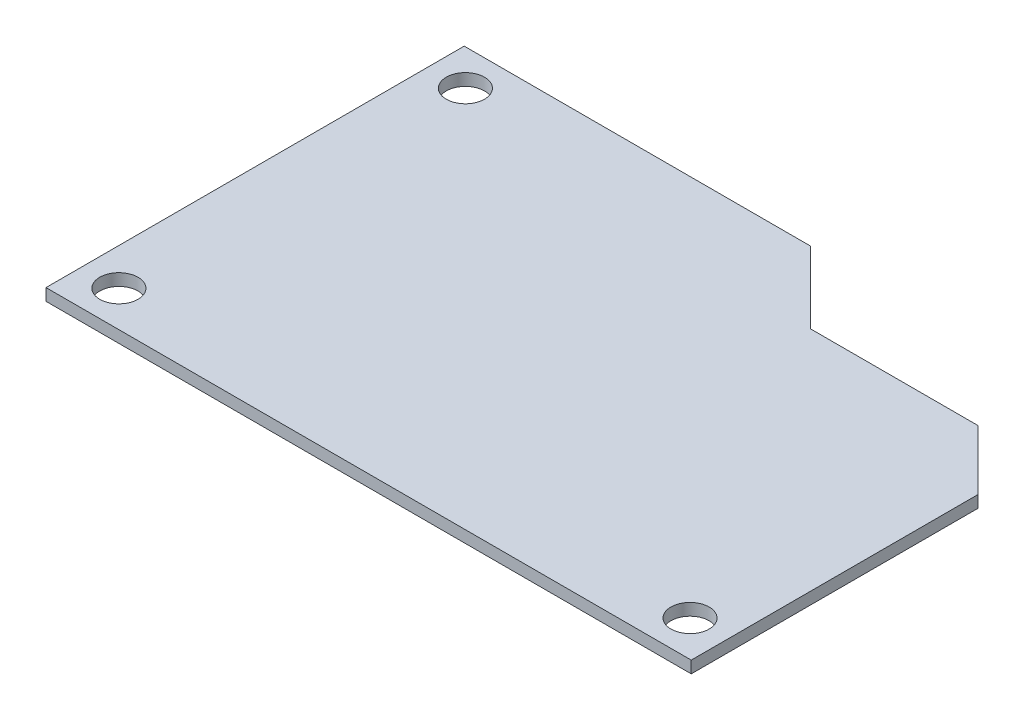
ISO-10303-21;
HEADER;
FILE_DESCRIPTION(('STEP AP214'),'2;1');
FILE_NAME('part.step','',(''),(''),'','','');
FILE_SCHEMA(('AUTOMOTIVE_DESIGN { 1 0 10303 214 1 1 1 1 }'));
ENDSEC;
DATA;
#1=APPLICATION_CONTEXT('core data for automotive mechanical design processes');
#2=APPLICATION_PROTOCOL_DEFINITION('international standard','automotive_design',2000,#1);
#3=PRODUCT_CONTEXT('',#1,'mechanical');
#4=PRODUCT('Part','Part','',(#3));
#5=PRODUCT_RELATED_PRODUCT_CATEGORY('part','',(#4));
#6=PRODUCT_DEFINITION_FORMATION('','',#4);
#7=PRODUCT_DEFINITION_CONTEXT('part definition',#1,'design');
#8=PRODUCT_DEFINITION('design','',#6,#7);
#9=PRODUCT_DEFINITION_SHAPE('','',#8);
#10=(LENGTH_UNIT() NAMED_UNIT(*) SI_UNIT(.MILLI.,.METRE.));
#11=(NAMED_UNIT(*) PLANE_ANGLE_UNIT() SI_UNIT($,.RADIAN.));
#12=(NAMED_UNIT(*) SI_UNIT($,.STERADIAN.) SOLID_ANGLE_UNIT());
#13=UNCERTAINTY_MEASURE_WITH_UNIT(LENGTH_MEASURE(1.E-05),#10,'distance_accuracy_value','');
#14=(GEOMETRIC_REPRESENTATION_CONTEXT(3) GLOBAL_UNCERTAINTY_ASSIGNED_CONTEXT((#13)) GLOBAL_UNIT_ASSIGNED_CONTEXT((#10,
#11,#12)) REPRESENTATION_CONTEXT('',''));
#15=CARTESIAN_POINT('',(0.,0.,0.));
#16=DIRECTION('',(0.,0.,1.));
#17=DIRECTION('',(1.,0.,0.));
#18=AXIS2_PLACEMENT_3D('',#15,#16,#17);
#19=CARTESIAN_POINT('',(27.,1.,-17.5));
#20=DIRECTION('',(-1.,0.,0.));
#21=DIRECTION('',(0.,0.,1.));
#22=AXIS2_PLACEMENT_3D('',#19,#20,#21);
#23=PLANE('',#22);
#24=DIRECTION('',(0.,0.,-1.));
#25=VECTOR('',#24,1.);
#26=CARTESIAN_POINT('',(27.,0.,-17.5));
#27=LINE('',#26,#25);
#28=CARTESIAN_POINT('',(27.,0.,17.5));
#29=VERTEX_POINT('',#28);
#30=CARTESIAN_POINT('',(27.,0.,-6.5));
#31=VERTEX_POINT('',#30);
#32=EDGE_CURVE('E129',#29,#31,#27,.T.);
#33=ORIENTED_EDGE('',*,*,#32,.T.);
#34=DIRECTION('',(0.,1.,0.));
#35=VECTOR('',#34,1.);
#36=CARTESIAN_POINT('',(27.,-27.3130005674953,-6.5));
#37=LINE('',#36,#35);
#38=CARTESIAN_POINT('',(27.,1.,-6.5));
#39=VERTEX_POINT('',#38);
#40=EDGE_CURVE('E150',#31,#39,#37,.T.);
#41=ORIENTED_EDGE('',*,*,#40,.T.);
#42=DIRECTION('',(0.,0.,-1.));
#43=VECTOR('',#42,1.);
#44=CARTESIAN_POINT('',(27.,1.,-17.5));
#45=LINE('',#44,#43);
#46=CARTESIAN_POINT('',(27.,1.,17.5));
#47=VERTEX_POINT('',#46);
#48=EDGE_CURVE('E121',#47,#39,#45,.T.);
#49=ORIENTED_EDGE('',*,*,#48,.F.);
#50=DIRECTION('',(0.,-1.,0.));
#51=VECTOR('',#50,1.);
#52=CARTESIAN_POINT('',(27.,1.,17.5));
#53=LINE('',#52,#51);
#54=EDGE_CURVE('E128',#47,#29,#53,.T.);
#55=ORIENTED_EDGE('',*,*,#54,.T.);
#56=EDGE_LOOP('',(#33,#41,#49,#55));
#57=FACE_BOUND('',#56,.T.);
#58=ADVANCED_FACE('F36',(#57),#23,.F.);
#59=CARTESIAN_POINT('',(-27.,1.,-17.5));
#60=DIRECTION('',(0.,0.,1.));
#61=DIRECTION('',(1.,0.,0.));
#62=AXIS2_PLACEMENT_3D('',#59,#60,#61);
#63=PLANE('',#62);
#64=DIRECTION('',(-1.,0.,0.));
#65=VECTOR('',#64,1.);
#66=CARTESIAN_POINT('',(-27.,1.,-17.5));
#67=LINE('',#66,#65);
#68=CARTESIAN_POINT('',(2.00000000000001,1.,-17.5));
#69=VERTEX_POINT('',#68);
#70=CARTESIAN_POINT('',(-27.,1.,-17.5));
#71=VERTEX_POINT('',#70);
#72=EDGE_CURVE('E81',#69,#71,#67,.T.);
#73=ORIENTED_EDGE('',*,*,#72,.F.);
#74=DIRECTION('',(0.,1.,0.));
#75=VECTOR('',#74,1.);
#76=CARTESIAN_POINT('',(2.00000000000001,-27.3130005674953,-17.5));
#77=LINE('',#76,#75);
#78=CARTESIAN_POINT('',(2.00000000000001,0.,-17.5));
#79=VERTEX_POINT('',#78);
#80=EDGE_CURVE('E102',#79,#69,#77,.T.);
#81=ORIENTED_EDGE('',*,*,#80,.F.);
#82=DIRECTION('',(-1.,0.,0.));
#83=VECTOR('',#82,1.);
#84=CARTESIAN_POINT('',(-27.,0.,-17.5));
#85=LINE('',#84,#83);
#86=CARTESIAN_POINT('',(-27.,0.,-17.5));
#87=VERTEX_POINT('',#86);
#88=EDGE_CURVE('E132',#79,#87,#85,.T.);
#89=ORIENTED_EDGE('',*,*,#88,.T.);
#90=DIRECTION('',(0.,-1.,0.));
#91=VECTOR('',#90,1.);
#92=CARTESIAN_POINT('',(-27.,1.,-17.5));
#93=LINE('',#92,#91);
#94=EDGE_CURVE('E11',#71,#87,#93,.T.);
#95=ORIENTED_EDGE('',*,*,#94,.F.);
#96=EDGE_LOOP('',(#73,#81,#89,#95));
#97=FACE_BOUND('',#96,.T.);
#98=ADVANCED_FACE('F118',(#97),#63,.F.);
#99=CARTESIAN_POINT('',(-27.,1.,-17.5));
#100=DIRECTION('',(1.,0.,0.));
#101=DIRECTION('',(0.,0.,-1.));
#102=AXIS2_PLACEMENT_3D('',#99,#100,#101);
#103=PLANE('',#102);
#104=DIRECTION('',(0.,0.,1.));
#105=VECTOR('',#104,1.);
#106=CARTESIAN_POINT('',(-27.,0.,-17.5));
#107=LINE('',#106,#105);
#108=CARTESIAN_POINT('',(-27.,0.,17.5));
#109=VERTEX_POINT('',#108);
#110=EDGE_CURVE('E134',#87,#109,#107,.T.);
#111=ORIENTED_EDGE('',*,*,#110,.T.);
#112=DIRECTION('',(0.,-1.,0.));
#113=VECTOR('',#112,1.);
#114=CARTESIAN_POINT('',(-27.,1.,17.5));
#115=LINE('',#114,#113);
#116=CARTESIAN_POINT('',(-27.,1.,17.5));
#117=VERTEX_POINT('',#116);
#118=EDGE_CURVE('E43',#117,#109,#115,.T.);
#119=ORIENTED_EDGE('',*,*,#118,.F.);
#120=DIRECTION('',(0.,0.,1.));
#121=VECTOR('',#120,1.);
#122=CARTESIAN_POINT('',(-27.,1.,-17.5));
#123=LINE('',#122,#121);
#124=EDGE_CURVE('E120',#71,#117,#123,.T.);
#125=ORIENTED_EDGE('',*,*,#124,.F.);
#126=ORIENTED_EDGE('',*,*,#94,.T.);
#127=EDGE_LOOP('',(#111,#119,#125,#126));
#128=FACE_BOUND('',#127,.T.);
#129=ADVANCED_FACE('F208',(#128),#103,.F.);
#130=CARTESIAN_POINT('',(-27.,1.,17.5));
#131=DIRECTION('',(0.,0.,-1.));
#132=DIRECTION('',(-1.,0.,0.));
#133=AXIS2_PLACEMENT_3D('',#130,#131,#132);
#134=PLANE('',#133);
#135=DIRECTION('',(1.,0.,0.));
#136=VECTOR('',#135,1.);
#137=CARTESIAN_POINT('',(-27.,0.,17.5));
#138=LINE('',#137,#136);
#139=EDGE_CURVE('E76',#109,#29,#138,.T.);
#140=ORIENTED_EDGE('',*,*,#139,.T.);
#141=ORIENTED_EDGE('',*,*,#54,.F.);
#142=DIRECTION('',(1.,0.,0.));
#143=VECTOR('',#142,1.);
#144=CARTESIAN_POINT('',(-27.,1.,17.5));
#145=LINE('',#144,#143);
#146=EDGE_CURVE('E59',#117,#47,#145,.T.);
#147=ORIENTED_EDGE('',*,*,#146,.F.);
#148=ORIENTED_EDGE('',*,*,#118,.T.);
#149=EDGE_LOOP('',(#140,#141,#147,#148));
#150=FACE_BOUND('',#149,.T.);
#151=ADVANCED_FACE('F138',(#150),#134,.F.);
#152=CARTESIAN_POINT('',(0.,1.,0.));
#153=DIRECTION('',(0.,1.,0.));
#154=DIRECTION('',(0.,0.,1.));
#155=AXIS2_PLACEMENT_3D('',#152,#153,#154);
#156=PLANE('',#155);
#157=CARTESIAN_POINT('',(-23.9,1.,14.5));
#158=DIRECTION('',(0.,1.,0.));
#159=DIRECTION('',(0.,0.,-1.));
#160=AXIS2_PLACEMENT_3D('',#157,#158,#159);
#161=CIRCLE('',#160,1.6);
#162=CARTESIAN_POINT('',(-23.9,1.,12.9));
#163=VERTEX_POINT('',#162);
#164=EDGE_CURVE('E172',#163,#163,#161,.T.);
#165=ORIENTED_EDGE('',*,*,#164,.F.);
#166=EDGE_LOOP('',(#165));
#167=FACE_BOUND('',#166,.T.);
#168=CARTESIAN_POINT('',(23.9,1.,14.5));
#169=DIRECTION('',(0.,1.,0.));
#170=DIRECTION('',(0.,0.,1.));
#171=AXIS2_PLACEMENT_3D('',#168,#169,#170);
#172=CIRCLE('',#171,1.6);
#173=CARTESIAN_POINT('',(23.9,1.,16.1));
#174=VERTEX_POINT('',#173);
#175=EDGE_CURVE('E173',#174,#174,#172,.T.);
#176=ORIENTED_EDGE('',*,*,#175,.F.);
#177=EDGE_LOOP('',(#176));
#178=FACE_BOUND('',#177,.T.);
#179=CARTESIAN_POINT('',(-23.9,1.,-14.5));
#180=DIRECTION('',(0.,1.,0.));
#181=DIRECTION('',(0.,0.,1.));
#182=AXIS2_PLACEMENT_3D('',#179,#180,#181);
#183=CIRCLE('',#182,1.6);
#184=CARTESIAN_POINT('',(-23.9,1.,-12.9));
#185=VERTEX_POINT('',#184);
#186=EDGE_CURVE('E165',#185,#185,#183,.T.);
#187=ORIENTED_EDGE('',*,*,#186,.F.);
#188=EDGE_LOOP('',(#187));
#189=FACE_BOUND('',#188,.T.);
#190=DIRECTION('',(0.707106781186547,0.,0.707106781186548));
#191=VECTOR('',#190,1.);
#192=CARTESIAN_POINT('',(22.,1.,-11.5));
#193=LINE('',#192,#191);
#194=CARTESIAN_POINT('',(22.,1.,-11.5));
#195=VERTEX_POINT('',#194);
#196=EDGE_CURVE('E110',#195,#39,#193,.T.);
#197=ORIENTED_EDGE('',*,*,#196,.F.);
#198=DIRECTION('',(1.,0.,0.));
#199=VECTOR('',#198,1.);
#200=CARTESIAN_POINT('',(8.00000000000001,1.,-11.5));
#201=LINE('',#200,#199);
#202=CARTESIAN_POINT('',(8.00000000000001,1.,-11.5));
#203=VERTEX_POINT('',#202);
#204=EDGE_CURVE('E115',#203,#195,#201,.T.);
#205=ORIENTED_EDGE('',*,*,#204,.F.);
#206=DIRECTION('',(0.707106781186547,0.,0.707106781186547));
#207=VECTOR('',#206,1.);
#208=CARTESIAN_POINT('',(2.00000000000001,1.,-17.5));
#209=LINE('',#208,#207);
#210=EDGE_CURVE('E104',#69,#203,#209,.T.);
#211=ORIENTED_EDGE('',*,*,#210,.F.);
#212=ORIENTED_EDGE('',*,*,#72,.T.);
#213=ORIENTED_EDGE('',*,*,#124,.T.);
#214=ORIENTED_EDGE('',*,*,#146,.T.);
#215=ORIENTED_EDGE('',*,*,#48,.T.);
#216=EDGE_LOOP('',(#197,#205,#211,#212,#213,#214,#215));
#217=FACE_BOUND('',#216,.T.);
#218=ADVANCED_FACE('F113',(#167,#178,#189,#217),#156,.T.);
#219=CARTESIAN_POINT('',(0.,0.,0.));
#220=DIRECTION('',(0.,1.,0.));
#221=DIRECTION('',(0.,0.,1.));
#222=AXIS2_PLACEMENT_3D('',#219,#220,#221);
#223=PLANE('',#222);
#224=CARTESIAN_POINT('',(-23.9,0.,14.5));
#225=DIRECTION('',(0.,1.,0.));
#226=DIRECTION('',(0.,0.,1.));
#227=AXIS2_PLACEMENT_3D('',#224,#225,#226);
#228=CIRCLE('',#227,1.6);
#229=CARTESIAN_POINT('',(-23.9,0.,16.1));
#230=VERTEX_POINT('',#229);
#231=EDGE_CURVE('E168',#230,#230,#228,.F.);
#232=ORIENTED_EDGE('',*,*,#231,.F.);
#233=EDGE_LOOP('',(#232));
#234=FACE_BOUND('',#233,.T.);
#235=CARTESIAN_POINT('',(23.9,0.,14.5));
#236=DIRECTION('',(0.,1.,0.));
#237=DIRECTION('',(0.,0.,1.));
#238=AXIS2_PLACEMENT_3D('',#235,#236,#237);
#239=CIRCLE('',#238,1.6);
#240=CARTESIAN_POINT('',(23.9,0.,16.1));
#241=VERTEX_POINT('',#240);
#242=EDGE_CURVE('E169',#241,#241,#239,.F.);
#243=ORIENTED_EDGE('',*,*,#242,.F.);
#244=EDGE_LOOP('',(#243));
#245=FACE_BOUND('',#244,.T.);
#246=CARTESIAN_POINT('',(-23.9,0.,-14.5));
#247=DIRECTION('',(0.,1.,0.));
#248=DIRECTION('',(0.,0.,1.));
#249=AXIS2_PLACEMENT_3D('',#246,#247,#248);
#250=CIRCLE('',#249,1.6);
#251=CARTESIAN_POINT('',(-23.9,0.,-12.9));
#252=VERTEX_POINT('',#251);
#253=EDGE_CURVE('E116',#252,#252,#250,.F.);
#254=ORIENTED_EDGE('',*,*,#253,.F.);
#255=EDGE_LOOP('',(#254));
#256=FACE_BOUND('',#255,.T.);
#257=DIRECTION('',(-1.,0.,0.));
#258=VECTOR('',#257,1.);
#259=CARTESIAN_POINT('',(8.00000000000001,0.,-11.5));
#260=LINE('',#259,#258);
#261=CARTESIAN_POINT('',(22.,0.,-11.5));
#262=VERTEX_POINT('',#261);
#263=CARTESIAN_POINT('',(8.00000000000001,0.,-11.5));
#264=VERTEX_POINT('',#263);
#265=EDGE_CURVE('E156',#262,#264,#260,.T.);
#266=ORIENTED_EDGE('',*,*,#265,.F.);
#267=DIRECTION('',(-0.707106781186547,0.,-0.707106781186548));
#268=VECTOR('',#267,1.);
#269=CARTESIAN_POINT('',(22.,0.,-11.5));
#270=LINE('',#269,#268);
#271=EDGE_CURVE('E146',#31,#262,#270,.T.);
#272=ORIENTED_EDGE('',*,*,#271,.F.);
#273=ORIENTED_EDGE('',*,*,#32,.F.);
#274=ORIENTED_EDGE('',*,*,#139,.F.);
#275=ORIENTED_EDGE('',*,*,#110,.F.);
#276=ORIENTED_EDGE('',*,*,#88,.F.);
#277=DIRECTION('',(-0.707106781186548,0.,-0.707106781186548));
#278=VECTOR('',#277,1.);
#279=CARTESIAN_POINT('',(2.00000000000001,0.,-17.5));
#280=LINE('',#279,#278);
#281=EDGE_CURVE('E107',#264,#79,#280,.T.);
#282=ORIENTED_EDGE('',*,*,#281,.F.);
#283=EDGE_LOOP('',(#266,#272,#273,#274,#275,#276,#282));
#284=FACE_BOUND('',#283,.T.);
#285=ADVANCED_FACE('F144',(#234,#245,#256,#284),#223,.F.);
#286=CARTESIAN_POINT('',(22.,-27.3130005674953,-11.5));
#287=DIRECTION('',(-0.707106781186548,0.,0.707106781186547));
#288=DIRECTION('',(0.707106781186547,0.,0.707106781186548));
#289=AXIS2_PLACEMENT_3D('',#286,#287,#288);
#290=PLANE('',#289);
#291=ORIENTED_EDGE('',*,*,#271,.T.);
#292=DIRECTION('',(0.,1.,0.));
#293=VECTOR('',#292,1.);
#294=CARTESIAN_POINT('',(22.,-27.3130005674953,-11.5));
#295=LINE('',#294,#293);
#296=EDGE_CURVE('E157',#262,#195,#295,.T.);
#297=ORIENTED_EDGE('',*,*,#296,.T.);
#298=ORIENTED_EDGE('',*,*,#196,.T.);
#299=ORIENTED_EDGE('',*,*,#40,.F.);
#300=EDGE_LOOP('',(#291,#297,#298,#299));
#301=FACE_BOUND('',#300,.T.);
#302=ADVANCED_FACE('F217',(#301),#290,.F.);
#303=CARTESIAN_POINT('',(8.00000000000001,-27.3130005674953,-11.5));
#304=DIRECTION('',(0.,0.,1.));
#305=DIRECTION('',(1.,0.,0.));
#306=AXIS2_PLACEMENT_3D('',#303,#304,#305);
#307=PLANE('',#306);
#308=ORIENTED_EDGE('',*,*,#265,.T.);
#309=DIRECTION('',(0.,1.,0.));
#310=VECTOR('',#309,1.);
#311=CARTESIAN_POINT('',(8.00000000000001,-27.3130005674953,-11.5));
#312=LINE('',#311,#310);
#313=EDGE_CURVE('E50',#264,#203,#312,.T.);
#314=ORIENTED_EDGE('',*,*,#313,.T.);
#315=ORIENTED_EDGE('',*,*,#204,.T.);
#316=ORIENTED_EDGE('',*,*,#296,.F.);
#317=EDGE_LOOP('',(#308,#314,#315,#316));
#318=FACE_BOUND('',#317,.T.);
#319=ADVANCED_FACE('F201',(#318),#307,.F.);
#320=CARTESIAN_POINT('',(2.00000000000001,-27.3130005674953,-17.5));
#321=DIRECTION('',(-0.707106781186547,0.,0.707106781186547));
#322=DIRECTION('',(0.707106781186548,0.,0.707106781186548));
#323=AXIS2_PLACEMENT_3D('',#320,#321,#322);
#324=PLANE('',#323);
#325=ORIENTED_EDGE('',*,*,#281,.T.);
#326=ORIENTED_EDGE('',*,*,#80,.T.);
#327=ORIENTED_EDGE('',*,*,#210,.T.);
#328=ORIENTED_EDGE('',*,*,#313,.F.);
#329=EDGE_LOOP('',(#325,#326,#327,#328));
#330=FACE_BOUND('',#329,.T.);
#331=ADVANCED_FACE('F103',(#330),#324,.F.);
#332=CARTESIAN_POINT('',(-23.9,-4.52548339959391,-14.5));
#333=DIRECTION('',(0.,1.,0.));
#334=DIRECTION('',(0.,0.,1.));
#335=AXIS2_PLACEMENT_3D('',#332,#333,#334);
#336=CYLINDRICAL_SURFACE('',#335,1.6);
#337=ORIENTED_EDGE('',*,*,#253,.T.);
#338=EDGE_LOOP('',(#337));
#339=FACE_BOUND('',#338,.T.);
#340=ORIENTED_EDGE('',*,*,#186,.T.);
#341=EDGE_LOOP('',(#340));
#342=FACE_BOUND('',#341,.T.);
#343=ADVANCED_FACE('F190',(#339,#342),#336,.F.);
#344=CARTESIAN_POINT('',(23.9,-4.52548339959391,14.5));
#345=DIRECTION('',(0.,1.,0.));
#346=DIRECTION('',(0.,0.,1.));
#347=AXIS2_PLACEMENT_3D('',#344,#345,#346);
#348=CYLINDRICAL_SURFACE('',#347,1.6);
#349=ORIENTED_EDGE('',*,*,#242,.T.);
#350=EDGE_LOOP('',(#349));
#351=FACE_BOUND('',#350,.T.);
#352=ORIENTED_EDGE('',*,*,#175,.T.);
#353=EDGE_LOOP('',(#352));
#354=FACE_BOUND('',#353,.T.);
#355=ADVANCED_FACE('F192',(#351,#354),#348,.F.);
#356=CARTESIAN_POINT('',(-23.9,-4.52548339959391,14.5));
#357=DIRECTION('',(0.,1.,0.));
#358=DIRECTION('',(0.,0.,1.));
#359=AXIS2_PLACEMENT_3D('',#356,#357,#358);
#360=CYLINDRICAL_SURFACE('',#359,1.6);
#361=ORIENTED_EDGE('',*,*,#231,.T.);
#362=EDGE_LOOP('',(#361));
#363=FACE_BOUND('',#362,.T.);
#364=ORIENTED_EDGE('',*,*,#164,.T.);
#365=EDGE_LOOP('',(#364));
#366=FACE_BOUND('',#365,.T.);
#367=ADVANCED_FACE('F181',(#363,#366),#360,.F.);
#368=CLOSED_SHELL('',(#58,#98,#129,#151,#218,#285,#302,#319,#331,#343,#355,#367));
#369=MANIFOLD_SOLID_BREP('B2',#368);
#370=ADVANCED_BREP_SHAPE_REPRESENTATION('',(#18,#369),#14);
#371=SHAPE_DEFINITION_REPRESENTATION(#9,#370);
ENDSEC;
END-ISO-10303-21;
